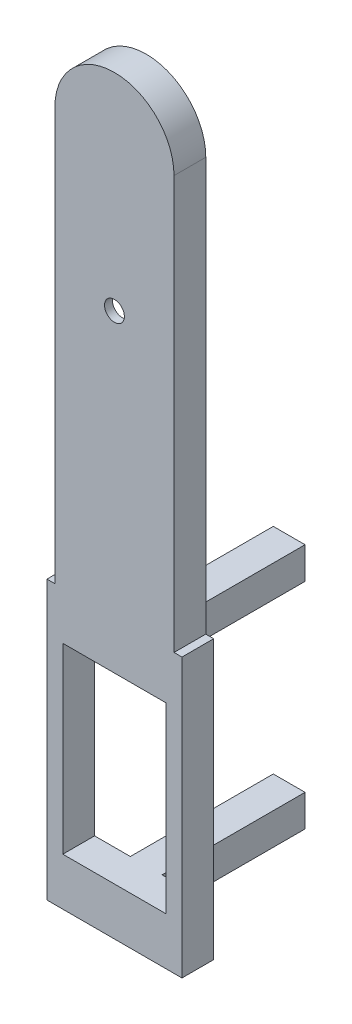
ISO-10303-21;
HEADER;
FILE_DESCRIPTION(('STEP AP214'),'2;1');
FILE_NAME('part.step','',(''),(''),'','','');
FILE_SCHEMA(('AUTOMOTIVE_DESIGN { 1 0 10303 214 1 1 1 1 }'));
ENDSEC;
DATA;
#1=APPLICATION_CONTEXT('core data for automotive mechanical design processes');
#2=APPLICATION_PROTOCOL_DEFINITION('international standard','automotive_design',2000,#1);
#3=PRODUCT_CONTEXT('',#1,'mechanical');
#4=PRODUCT('Part','Part','',(#3));
#5=PRODUCT_RELATED_PRODUCT_CATEGORY('part','',(#4));
#6=PRODUCT_DEFINITION_FORMATION('','',#4);
#7=PRODUCT_DEFINITION_CONTEXT('part definition',#1,'design');
#8=PRODUCT_DEFINITION('design','',#6,#7);
#9=PRODUCT_DEFINITION_SHAPE('','',#8);
#10=(LENGTH_UNIT() NAMED_UNIT(*) SI_UNIT(.MILLI.,.METRE.));
#11=(NAMED_UNIT(*) PLANE_ANGLE_UNIT() SI_UNIT($,.RADIAN.));
#12=(NAMED_UNIT(*) SI_UNIT($,.STERADIAN.) SOLID_ANGLE_UNIT());
#13=UNCERTAINTY_MEASURE_WITH_UNIT(LENGTH_MEASURE(1.E-05),#10,'distance_accuracy_value','');
#14=(GEOMETRIC_REPRESENTATION_CONTEXT(3) GLOBAL_UNCERTAINTY_ASSIGNED_CONTEXT((#13)) GLOBAL_UNIT_ASSIGNED_CONTEXT((#10,
#11,#12)) REPRESENTATION_CONTEXT('',''));
#15=CARTESIAN_POINT('',(0.,0.,0.));
#16=DIRECTION('',(0.,0.,1.));
#17=DIRECTION('',(1.,0.,0.));
#18=AXIS2_PLACEMENT_3D('',#15,#16,#17);
#19=CARTESIAN_POINT('',(0.,52.,4.));
#20=DIRECTION('',(0.,0.,1.));
#21=DIRECTION('',(1.,0.,0.));
#22=AXIS2_PLACEMENT_3D('',#19,#20,#21);
#23=PLANE('',#22);
#24=CARTESIAN_POINT('',(0.,33.5,4.));
#25=DIRECTION('',(0.,0.,1.));
#26=DIRECTION('',(1.,0.,0.));
#27=AXIS2_PLACEMENT_3D('',#24,#25,#26);
#28=CIRCLE('',#27,1.25);
#29=CARTESIAN_POINT('',(1.25,33.5,4.));
#30=VERTEX_POINT('',#29);
#31=EDGE_CURVE('E403',#30,#30,#28,.F.);
#32=ORIENTED_EDGE('',*,*,#31,.T.);
#33=EDGE_LOOP('',(#32));
#34=FACE_BOUND('',#33,.T.);
#35=DIRECTION('',(0.,-1.,0.));
#36=VECTOR('',#35,1.);
#37=CARTESIAN_POINT('',(-7.5,0.,4.));
#38=LINE('',#37,#36);
#39=CARTESIAN_POINT('',(-7.5,52.,4.));
#40=VERTEX_POINT('',#39);
#41=CARTESIAN_POINT('',(-7.5,0.,4.));
#42=VERTEX_POINT('',#41);
#43=EDGE_CURVE('E477',#40,#42,#38,.T.);
#44=ORIENTED_EDGE('',*,*,#43,.T.);
#45=DIRECTION('',(-1.,0.,0.));
#46=VECTOR('',#45,1.);
#47=CARTESIAN_POINT('',(8.50000000000001,0.,4.));
#48=LINE('',#47,#46);
#49=CARTESIAN_POINT('',(-8.49999999999999,0.,4.));
#50=VERTEX_POINT('',#49);
#51=EDGE_CURVE('E361',#42,#50,#48,.T.);
#52=ORIENTED_EDGE('',*,*,#51,.T.);
#53=DIRECTION('',(0.,-1.,0.));
#54=VECTOR('',#53,1.);
#55=CARTESIAN_POINT('',(-8.49999999999999,0.,4.));
#56=LINE('',#55,#54);
#57=CARTESIAN_POINT('',(-8.49999999999999,-35.,4.));
#58=VERTEX_POINT('',#57);
#59=EDGE_CURVE('E367',#50,#58,#56,.T.);
#60=ORIENTED_EDGE('',*,*,#59,.T.);
#61=DIRECTION('',(1.,0.,0.));
#62=VECTOR('',#61,1.);
#63=CARTESIAN_POINT('',(8.50000000000001,-35.,4.));
#64=LINE('',#63,#62);
#65=CARTESIAN_POINT('',(8.50000000000001,-35.,4.));
#66=VERTEX_POINT('',#65);
#67=EDGE_CURVE('E370',#58,#66,#64,.T.);
#68=ORIENTED_EDGE('',*,*,#67,.T.);
#69=DIRECTION('',(0.,1.,0.));
#70=VECTOR('',#69,1.);
#71=CARTESIAN_POINT('',(8.50000000000001,0.,4.));
#72=LINE('',#71,#70);
#73=CARTESIAN_POINT('',(8.50000000000001,0.,4.));
#74=VERTEX_POINT('',#73);
#75=EDGE_CURVE('E357',#66,#74,#72,.T.);
#76=ORIENTED_EDGE('',*,*,#75,.T.);
#77=CARTESIAN_POINT('',(7.5,0.,4.));
#78=VERTEX_POINT('',#77);
#79=EDGE_CURVE('E363',#74,#78,#48,.T.);
#80=ORIENTED_EDGE('',*,*,#79,.T.);
#81=DIRECTION('',(0.,1.,0.));
#82=VECTOR('',#81,1.);
#83=CARTESIAN_POINT('',(7.5,0.,4.));
#84=LINE('',#83,#82);
#85=CARTESIAN_POINT('',(7.5,52.,4.));
#86=VERTEX_POINT('',#85);
#87=EDGE_CURVE('E470',#78,#86,#84,.T.);
#88=ORIENTED_EDGE('',*,*,#87,.T.);
#89=CARTESIAN_POINT('',(0.,52.,4.));
#90=DIRECTION('',(0.,0.,1.));
#91=DIRECTION('',(1.,0.,0.));
#92=AXIS2_PLACEMENT_3D('',#89,#90,#91);
#93=CIRCLE('',#92,7.5);
#94=EDGE_CURVE('E473',#86,#40,#93,.T.);
#95=ORIENTED_EDGE('',*,*,#94,.T.);
#96=EDGE_LOOP('',(#44,#52,#60,#68,#76,#80,#88,#95));
#97=FACE_BOUND('',#96,.T.);
#98=DIRECTION('',(-1.,0.,0.));
#99=VECTOR('',#98,1.);
#100=CARTESIAN_POINT('',(0.,-29.,4.));
#101=LINE('',#100,#99);
#102=CARTESIAN_POINT('',(6.50000000000001,-29.,4.));
#103=VERTEX_POINT('',#102);
#104=CARTESIAN_POINT('',(-6.49999999999999,-29.,4.));
#105=VERTEX_POINT('',#104);
#106=EDGE_CURVE('E348',#103,#105,#101,.T.);
#107=ORIENTED_EDGE('',*,*,#106,.T.);
#108=DIRECTION('',(0.,1.,0.));
#109=VECTOR('',#108,1.);
#110=CARTESIAN_POINT('',(-6.5,52.,4.));
#111=LINE('',#110,#109);
#112=CARTESIAN_POINT('',(-6.49999999999999,-6.00000000000001,4.));
#113=VERTEX_POINT('',#112);
#114=EDGE_CURVE('E352',#105,#113,#111,.T.);
#115=ORIENTED_EDGE('',*,*,#114,.T.);
#116=DIRECTION('',(1.,0.,0.));
#117=VECTOR('',#116,1.);
#118=CARTESIAN_POINT('',(0.,-6.00000000000001,4.));
#119=LINE('',#118,#117);
#120=CARTESIAN_POINT('',(6.50000000000001,-6.00000000000001,4.));
#121=VERTEX_POINT('',#120);
#122=EDGE_CURVE('E340',#113,#121,#119,.T.);
#123=ORIENTED_EDGE('',*,*,#122,.T.);
#124=DIRECTION('',(0.,-1.,0.));
#125=VECTOR('',#124,1.);
#126=CARTESIAN_POINT('',(6.5,52.,4.));
#127=LINE('',#126,#125);
#128=EDGE_CURVE('E344',#121,#103,#127,.T.);
#129=ORIENTED_EDGE('',*,*,#128,.T.);
#130=EDGE_LOOP('',(#107,#115,#123,#129));
#131=FACE_BOUND('',#130,.T.);
#132=ADVANCED_FACE('F39',(#34,#97,#131),#23,.T.);
#133=CARTESIAN_POINT('',(0.,52.,0.));
#134=DIRECTION('',(0.,0.,1.));
#135=DIRECTION('',(1.,0.,0.));
#136=AXIS2_PLACEMENT_3D('',#133,#134,#135);
#137=PLANE('',#136);
#138=DIRECTION('',(0.,1.,0.));
#139=VECTOR('',#138,1.);
#140=CARTESIAN_POINT('',(7.5,0.,0.));
#141=LINE('',#140,#139);
#142=CARTESIAN_POINT('',(7.5,0.,0.));
#143=VERTEX_POINT('',#142);
#144=CARTESIAN_POINT('',(7.5,52.,0.));
#145=VERTEX_POINT('',#144);
#146=EDGE_CURVE('E469',#143,#145,#141,.T.);
#147=ORIENTED_EDGE('',*,*,#146,.F.);
#148=DIRECTION('',(-1.,0.,0.));
#149=VECTOR('',#148,1.);
#150=CARTESIAN_POINT('',(8.50000000000001,0.,0.));
#151=LINE('',#150,#149);
#152=CARTESIAN_POINT('',(8.50000000000001,0.,0.));
#153=VERTEX_POINT('',#152);
#154=EDGE_CURVE('E378',#153,#143,#151,.T.);
#155=ORIENTED_EDGE('',*,*,#154,.F.);
#156=DIRECTION('',(0.,1.,0.));
#157=VECTOR('',#156,1.);
#158=CARTESIAN_POINT('',(8.50000000000001,0.,0.));
#159=LINE('',#158,#157);
#160=CARTESIAN_POINT('',(8.50000000000001,-35.,0.));
#161=VERTEX_POINT('',#160);
#162=EDGE_CURVE('E356',#161,#153,#159,.T.);
#163=ORIENTED_EDGE('',*,*,#162,.F.);
#164=DIRECTION('',(1.,0.,0.));
#165=VECTOR('',#164,1.);
#166=CARTESIAN_POINT('',(8.50000000000001,-35.,0.));
#167=LINE('',#166,#165);
#168=CARTESIAN_POINT('',(-8.49999999999999,-35.,0.));
#169=VERTEX_POINT('',#168);
#170=EDGE_CURVE('E362',#169,#161,#167,.T.);
#171=ORIENTED_EDGE('',*,*,#170,.F.);
#172=DIRECTION('',(0.,-1.,0.));
#173=VECTOR('',#172,1.);
#174=CARTESIAN_POINT('',(-8.49999999999999,0.,0.));
#175=LINE('',#174,#173);
#176=CARTESIAN_POINT('',(-8.49999999999999,0.,0.));
#177=VERTEX_POINT('',#176);
#178=EDGE_CURVE('E382',#177,#169,#175,.T.);
#179=ORIENTED_EDGE('',*,*,#178,.F.);
#180=CARTESIAN_POINT('',(-7.5,0.,0.));
#181=VERTEX_POINT('',#180);
#182=EDGE_CURVE('E377',#181,#177,#151,.T.);
#183=ORIENTED_EDGE('',*,*,#182,.F.);
#184=DIRECTION('',(0.,-1.,0.));
#185=VECTOR('',#184,1.);
#186=CARTESIAN_POINT('',(-7.5,0.,0.));
#187=LINE('',#186,#185);
#188=CARTESIAN_POINT('',(-7.5,52.,0.));
#189=VERTEX_POINT('',#188);
#190=EDGE_CURVE('E474',#189,#181,#187,.T.);
#191=ORIENTED_EDGE('',*,*,#190,.F.);
#192=CARTESIAN_POINT('',(0.,52.,0.));
#193=DIRECTION('',(0.,0.,1.));
#194=DIRECTION('',(1.,0.,0.));
#195=AXIS2_PLACEMENT_3D('',#192,#193,#194);
#196=CIRCLE('',#195,7.5);
#197=EDGE_CURVE('E483',#145,#189,#196,.T.);
#198=ORIENTED_EDGE('',*,*,#197,.F.);
#199=EDGE_LOOP('',(#147,#155,#163,#171,#179,#183,#191,#198));
#200=FACE_BOUND('',#199,.T.);
#201=DIRECTION('',(-0.161684528353419,0.986842496699008,0.));
#202=VECTOR('',#201,1.);
#203=CARTESIAN_POINT('',(10.214455548325,1.67353902293652,0.));
#204=LINE('',#203,#202);
#205=CARTESIAN_POINT('',(5.,33.5,0.));
#206=VERTEX_POINT('',#205);
#207=CARTESIAN_POINT('',(2.5,48.7587651204003,0.));
#208=VERTEX_POINT('',#207);
#209=EDGE_CURVE('E413',#206,#208,#204,.T.);
#210=ORIENTED_EDGE('',*,*,#209,.T.);
#211=CARTESIAN_POINT('',(0.,48.7587651204003,0.));
#212=DIRECTION('',(0.,0.,1.));
#213=DIRECTION('',(1.,0.,0.));
#214=AXIS2_PLACEMENT_3D('',#211,#212,#213);
#215=CIRCLE('',#214,2.5);
#216=CARTESIAN_POINT('',(-2.5,48.7587651204003,0.));
#217=VERTEX_POINT('',#216);
#218=EDGE_CURVE('E407',#217,#208,#215,.F.);
#219=ORIENTED_EDGE('',*,*,#218,.F.);
#220=DIRECTION('',(-0.161684528353419,-0.986842496699008,0.));
#221=VECTOR('',#220,1.);
#222=CARTESIAN_POINT('',(-10.214455548325,1.67353902293652,0.));
#223=LINE('',#222,#221);
#224=CARTESIAN_POINT('',(-5.,33.5,0.));
#225=VERTEX_POINT('',#224);
#226=EDGE_CURVE('E432',#217,#225,#223,.T.);
#227=ORIENTED_EDGE('',*,*,#226,.T.);
#228=DIRECTION('',(0.161684528353559,-0.986842496698985,0.));
#229=VECTOR('',#228,1.);
#230=CARTESIAN_POINT('',(0.475874415418367,0.0779673865584585,0.));
#231=LINE('',#230,#229);
#232=CARTESIAN_POINT('',(-2.49999999999778,18.2412348795997,0.));
#233=VERTEX_POINT('',#232);
#234=EDGE_CURVE('E436',#225,#233,#231,.T.);
#235=ORIENTED_EDGE('',*,*,#234,.T.);
#236=CARTESIAN_POINT('',(0.,18.2412348795997,0.));
#237=DIRECTION('',(0.,0.,1.));
#238=DIRECTION('',(1.,0.,0.));
#239=AXIS2_PLACEMENT_3D('',#236,#237,#238);
#240=CIRCLE('',#239,2.49999999999778);
#241=CARTESIAN_POINT('',(2.46793907135045,17.8421399784913,0.));
#242=VERTEX_POINT('',#241);
#243=EDGE_CURVE('E440',#233,#242,#240,.T.);
#244=ORIENTED_EDGE('',*,*,#243,.T.);
#245=DIRECTION('',(-0.159637960443526,-0.987175628541057,0.));
#246=VECTOR('',#245,1.);
#247=CARTESIAN_POINT('',(-0.40670997405781,0.0657698071888002,0.));
#248=LINE('',#247,#246);
#249=EDGE_CURVE('E444',#206,#242,#248,.T.);
#250=ORIENTED_EDGE('',*,*,#249,.F.);
#251=EDGE_LOOP('',(#210,#219,#227,#235,#244,#250));
#252=FACE_BOUND('',#251,.T.);
#253=DIRECTION('',(1.,0.,0.));
#254=VECTOR('',#253,1.);
#255=CARTESIAN_POINT('',(2.00000000000001,-33.,0.));
#256=LINE('',#255,#254);
#257=CARTESIAN_POINT('',(-1.99999999999999,-33.,0.));
#258=VERTEX_POINT('',#257);
#259=CARTESIAN_POINT('',(2.00000000000001,-33.,0.));
#260=VERTEX_POINT('',#259);
#261=EDGE_CURVE('E55',#258,#260,#256,.T.);
#262=ORIENTED_EDGE('',*,*,#261,.T.);
#263=DIRECTION('',(0.,1.,0.));
#264=VECTOR('',#263,1.);
#265=CARTESIAN_POINT('',(2.00000000000001,-33.,0.));
#266=LINE('',#265,#264);
#267=CARTESIAN_POINT('',(2.00000000000001,-29.,0.));
#268=VERTEX_POINT('',#267);
#269=EDGE_CURVE('E251',#260,#268,#266,.T.);
#270=ORIENTED_EDGE('',*,*,#269,.T.);
#271=DIRECTION('',(1.,0.,0.));
#272=VECTOR('',#271,1.);
#273=CARTESIAN_POINT('',(-6.49999999999999,-29.,0.));
#274=LINE('',#273,#272);
#275=CARTESIAN_POINT('',(6.50000000000001,-29.,0.));
#276=VERTEX_POINT('',#275);
#277=EDGE_CURVE('E219',#268,#276,#274,.T.);
#278=ORIENTED_EDGE('',*,*,#277,.T.);
#279=DIRECTION('',(0.,1.,0.));
#280=VECTOR('',#279,1.);
#281=CARTESIAN_POINT('',(6.50000000000001,-6.00000000000001,0.));
#282=LINE('',#281,#280);
#283=CARTESIAN_POINT('',(6.50000000000001,-6.00000000000001,0.));
#284=VERTEX_POINT('',#283);
#285=EDGE_CURVE('E318',#276,#284,#282,.T.);
#286=ORIENTED_EDGE('',*,*,#285,.T.);
#287=DIRECTION('',(-1.,0.,0.));
#288=VECTOR('',#287,1.);
#289=CARTESIAN_POINT('',(-6.49999999999999,-6.00000000000001,0.));
#290=LINE('',#289,#288);
#291=CARTESIAN_POINT('',(2.00000000000001,-6.00000000000001,0.));
#292=VERTEX_POINT('',#291);
#293=EDGE_CURVE('E323',#284,#292,#290,.T.);
#294=ORIENTED_EDGE('',*,*,#293,.T.);
#295=DIRECTION('',(0.,1.,0.));
#296=VECTOR('',#295,1.);
#297=CARTESIAN_POINT('',(2.00000000000001,-2.00000000000001,0.));
#298=LINE('',#297,#296);
#299=CARTESIAN_POINT('',(2.00000000000001,-2.00000000000001,0.));
#300=VERTEX_POINT('',#299);
#301=EDGE_CURVE('E267',#292,#300,#298,.T.);
#302=ORIENTED_EDGE('',*,*,#301,.T.);
#303=DIRECTION('',(-1.,0.,0.));
#304=VECTOR('',#303,1.);
#305=CARTESIAN_POINT('',(2.00000000000001,-2.00000000000001,0.));
#306=LINE('',#305,#304);
#307=CARTESIAN_POINT('',(-1.99999999999999,-2.00000000000001,0.));
#308=VERTEX_POINT('',#307);
#309=EDGE_CURVE('E293',#300,#308,#306,.T.);
#310=ORIENTED_EDGE('',*,*,#309,.T.);
#311=DIRECTION('',(0.,-1.,0.));
#312=VECTOR('',#311,1.);
#313=CARTESIAN_POINT('',(-1.99999999999999,-2.00000000000001,0.));
#314=LINE('',#313,#312);
#315=CARTESIAN_POINT('',(-1.99999999999999,-6.00000000000001,0.));
#316=VERTEX_POINT('',#315);
#317=EDGE_CURVE('E277',#308,#316,#314,.T.);
#318=ORIENTED_EDGE('',*,*,#317,.T.);
#319=CARTESIAN_POINT('',(-6.49999999999999,-6.00000000000001,0.));
#320=VERTEX_POINT('',#319);
#321=EDGE_CURVE('E322',#316,#320,#290,.T.);
#322=ORIENTED_EDGE('',*,*,#321,.T.);
#323=DIRECTION('',(0.,-1.,0.));
#324=VECTOR('',#323,1.);
#325=CARTESIAN_POINT('',(-6.49999999999999,-6.00000000000001,0.));
#326=LINE('',#325,#324);
#327=CARTESIAN_POINT('',(-6.49999999999999,-29.,0.));
#328=VERTEX_POINT('',#327);
#329=EDGE_CURVE('E303',#320,#328,#326,.T.);
#330=ORIENTED_EDGE('',*,*,#329,.T.);
#331=CARTESIAN_POINT('',(-1.99999999999999,-29.,0.));
#332=VERTEX_POINT('',#331);
#333=EDGE_CURVE('E315',#328,#332,#274,.T.);
#334=ORIENTED_EDGE('',*,*,#333,.T.);
#335=DIRECTION('',(0.,-1.,0.));
#336=VECTOR('',#335,1.);
#337=CARTESIAN_POINT('',(-1.99999999999999,-33.,0.));
#338=LINE('',#337,#336);
#339=EDGE_CURVE('E60',#332,#258,#338,.T.);
#340=ORIENTED_EDGE('',*,*,#339,.T.);
#341=EDGE_LOOP('',(#262,#270,#278,#286,#294,#302,#310,#318,#322,#330,#334,#340));
#342=FACE_BOUND('',#341,.T.);
#343=ADVANCED_FACE('F526',(#200,#252,#342),#137,.F.);
#344=CARTESIAN_POINT('',(7.5,0.,4.));
#345=DIRECTION('',(-1.,0.,0.));
#346=DIRECTION('',(0.,0.,1.));
#347=AXIS2_PLACEMENT_3D('',#344,#345,#346);
#348=PLANE('',#347);
#349=ORIENTED_EDGE('',*,*,#146,.T.);
#350=DIRECTION('',(0.,0.,-1.));
#351=VECTOR('',#350,1.);
#352=CARTESIAN_POINT('',(7.5,52.,4.));
#353=LINE('',#352,#351);
#354=EDGE_CURVE('E495',#86,#145,#353,.T.);
#355=ORIENTED_EDGE('',*,*,#354,.F.);
#356=ORIENTED_EDGE('',*,*,#87,.F.);
#357=DIRECTION('',(0.,0.,-1.));
#358=VECTOR('',#357,1.);
#359=CARTESIAN_POINT('',(7.5,0.,4.));
#360=LINE('',#359,#358);
#361=EDGE_CURVE('E271',#78,#143,#360,.T.);
#362=ORIENTED_EDGE('',*,*,#361,.T.);
#363=EDGE_LOOP('',(#349,#355,#356,#362));
#364=FACE_BOUND('',#363,.T.);
#365=ADVANCED_FACE('F41',(#364),#348,.F.);
#366=CARTESIAN_POINT('',(0.,52.,4.));
#367=DIRECTION('',(0.,0.,-1.));
#368=DIRECTION('',(-1.,0.,0.));
#369=AXIS2_PLACEMENT_3D('',#366,#367,#368);
#370=CYLINDRICAL_SURFACE('',#369,7.5);
#371=ORIENTED_EDGE('',*,*,#197,.T.);
#372=DIRECTION('',(0.,0.,-1.));
#373=VECTOR('',#372,1.);
#374=CARTESIAN_POINT('',(-7.5,52.,4.));
#375=LINE('',#374,#373);
#376=EDGE_CURVE('E491',#40,#189,#375,.T.);
#377=ORIENTED_EDGE('',*,*,#376,.F.);
#378=ORIENTED_EDGE('',*,*,#94,.F.);
#379=ORIENTED_EDGE('',*,*,#354,.T.);
#380=EDGE_LOOP('',(#371,#377,#378,#379));
#381=FACE_BOUND('',#380,.T.);
#382=ADVANCED_FACE('F563',(#381),#370,.T.);
#383=CARTESIAN_POINT('',(-7.5,0.,4.));
#384=DIRECTION('',(1.,0.,0.));
#385=DIRECTION('',(0.,0.,-1.));
#386=AXIS2_PLACEMENT_3D('',#383,#384,#385);
#387=PLANE('',#386);
#388=ORIENTED_EDGE('',*,*,#190,.T.);
#389=DIRECTION('',(0.,0.,-1.));
#390=VECTOR('',#389,1.);
#391=CARTESIAN_POINT('',(-7.5,0.,4.));
#392=LINE('',#391,#390);
#393=EDGE_CURVE('E480',#42,#181,#392,.T.);
#394=ORIENTED_EDGE('',*,*,#393,.F.);
#395=ORIENTED_EDGE('',*,*,#43,.F.);
#396=ORIENTED_EDGE('',*,*,#376,.T.);
#397=EDGE_LOOP('',(#388,#394,#395,#396));
#398=FACE_BOUND('',#397,.T.);
#399=ADVANCED_FACE('F548',(#398),#387,.F.);
#400=CARTESIAN_POINT('',(0.,48.7587651204003,3.));
#401=DIRECTION('',(0.,0.,-1.));
#402=DIRECTION('',(-1.,0.,0.));
#403=AXIS2_PLACEMENT_3D('',#400,#401,#402);
#404=CYLINDRICAL_SURFACE('',#403,2.5);
#405=ORIENTED_EDGE('',*,*,#218,.T.);
#406=DIRECTION('',(0.,0.,-1.));
#407=VECTOR('',#406,1.);
#408=CARTESIAN_POINT('',(2.5,48.7587651204003,3.));
#409=LINE('',#408,#407);
#410=CARTESIAN_POINT('',(2.5,48.7587651204003,3.));
#411=VERTEX_POINT('',#410);
#412=EDGE_CURVE('E429',#411,#208,#409,.T.);
#413=ORIENTED_EDGE('',*,*,#412,.F.);
#414=CARTESIAN_POINT('',(0.,48.7587651204003,3.));
#415=DIRECTION('',(0.,0.,1.));
#416=DIRECTION('',(1.,0.,0.));
#417=AXIS2_PLACEMENT_3D('',#414,#415,#416);
#418=CIRCLE('',#417,2.5);
#419=CARTESIAN_POINT('',(-2.5,48.7587651204003,3.));
#420=VERTEX_POINT('',#419);
#421=EDGE_CURVE('E408',#420,#411,#418,.F.);
#422=ORIENTED_EDGE('',*,*,#421,.F.);
#423=DIRECTION('',(0.,0.,-1.));
#424=VECTOR('',#423,1.);
#425=CARTESIAN_POINT('',(-2.5,48.7587651204003,3.));
#426=LINE('',#425,#424);
#427=EDGE_CURVE('E466',#420,#217,#426,.T.);
#428=ORIENTED_EDGE('',*,*,#427,.T.);
#429=EDGE_LOOP('',(#405,#413,#422,#428));
#430=FACE_BOUND('',#429,.T.);
#431=ADVANCED_FACE('F519',(#430),#404,.F.);
#432=CARTESIAN_POINT('',(-10.214455548325,1.67353902293652,3.));
#433=DIRECTION('',(0.986842496699008,-0.161684528353419,0.));
#434=DIRECTION('',(0.161684528353419,0.986842496699008,0.));
#435=AXIS2_PLACEMENT_3D('',#432,#433,#434);
#436=PLANE('',#435);
#437=ORIENTED_EDGE('',*,*,#226,.F.);
#438=ORIENTED_EDGE('',*,*,#427,.F.);
#439=DIRECTION('',(-0.161684528353419,-0.986842496699008,0.));
#440=VECTOR('',#439,1.);
#441=CARTESIAN_POINT('',(-10.214455548325,1.67353902293652,3.));
#442=LINE('',#441,#440);
#443=CARTESIAN_POINT('',(-5.,33.5,3.));
#444=VERTEX_POINT('',#443);
#445=EDGE_CURVE('E412',#420,#444,#442,.T.);
#446=ORIENTED_EDGE('',*,*,#445,.T.);
#447=DIRECTION('',(0.,0.,-1.));
#448=VECTOR('',#447,1.);
#449=CARTESIAN_POINT('',(-5.,33.5,3.));
#450=LINE('',#449,#448);
#451=EDGE_CURVE('E463',#444,#225,#450,.T.);
#452=ORIENTED_EDGE('',*,*,#451,.T.);
#453=EDGE_LOOP('',(#437,#438,#446,#452));
#454=FACE_BOUND('',#453,.T.);
#455=ADVANCED_FACE('F540',(#454),#436,.T.);
#456=CARTESIAN_POINT('',(0.475874415418367,0.0779673865584585,3.));
#457=DIRECTION('',(0.986842496698985,0.161684528353559,0.));
#458=DIRECTION('',(-0.161684528353559,0.986842496698985,0.));
#459=AXIS2_PLACEMENT_3D('',#456,#457,#458);
#460=PLANE('',#459);
#461=ORIENTED_EDGE('',*,*,#234,.F.);
#462=ORIENTED_EDGE('',*,*,#451,.F.);
#463=DIRECTION('',(0.161684528353559,-0.986842496698985,0.));
#464=VECTOR('',#463,1.);
#465=CARTESIAN_POINT('',(0.475874415418367,0.0779673865584585,3.));
#466=LINE('',#465,#464);
#467=CARTESIAN_POINT('',(-2.49999999999778,18.2412348795997,3.));
#468=VERTEX_POINT('',#467);
#469=EDGE_CURVE('E416',#444,#468,#466,.T.);
#470=ORIENTED_EDGE('',*,*,#469,.T.);
#471=DIRECTION('',(0.,0.,-1.));
#472=VECTOR('',#471,1.);
#473=CARTESIAN_POINT('',(-2.49999999999778,18.2412348795997,3.));
#474=LINE('',#473,#472);
#475=EDGE_CURVE('E460',#468,#233,#474,.T.);
#476=ORIENTED_EDGE('',*,*,#475,.T.);
#477=EDGE_LOOP('',(#461,#462,#470,#476));
#478=FACE_BOUND('',#477,.T.);
#479=ADVANCED_FACE('F537',(#478),#460,.T.);
#480=CARTESIAN_POINT('',(0.,18.2412348795997,3.));
#481=DIRECTION('',(0.,0.,-1.));
#482=DIRECTION('',(-1.,0.,0.));
#483=AXIS2_PLACEMENT_3D('',#480,#481,#482);
#484=CYLINDRICAL_SURFACE('',#483,2.49999999999778);
#485=ORIENTED_EDGE('',*,*,#243,.F.);
#486=ORIENTED_EDGE('',*,*,#475,.F.);
#487=CARTESIAN_POINT('',(0.,18.2412348795997,3.));
#488=DIRECTION('',(0.,0.,1.));
#489=DIRECTION('',(1.,0.,0.));
#490=AXIS2_PLACEMENT_3D('',#487,#488,#489);
#491=CIRCLE('',#490,2.49999999999778);
#492=CARTESIAN_POINT('',(2.46793907135045,17.8421399784913,3.));
#493=VERTEX_POINT('',#492);
#494=EDGE_CURVE('E419',#468,#493,#491,.T.);
#495=ORIENTED_EDGE('',*,*,#494,.T.);
#496=DIRECTION('',(0.,0.,-1.));
#497=VECTOR('',#496,1.);
#498=CARTESIAN_POINT('',(2.46793907135045,17.8421399784913,3.));
#499=LINE('',#498,#497);
#500=EDGE_CURVE('E457',#493,#242,#499,.T.);
#501=ORIENTED_EDGE('',*,*,#500,.T.);
#502=EDGE_LOOP('',(#485,#486,#495,#501));
#503=FACE_BOUND('',#502,.T.);
#504=ADVANCED_FACE('F534',(#503),#484,.F.);
#505=CARTESIAN_POINT('',(-0.40670997405781,0.0657698071888002,3.));
#506=DIRECTION('',(0.987175628541057,-0.159637960443526,0.));
#507=DIRECTION('',(0.159637960443526,0.987175628541057,0.));
#508=AXIS2_PLACEMENT_3D('',#505,#506,#507);
#509=PLANE('',#508);
#510=ORIENTED_EDGE('',*,*,#249,.T.);
#511=ORIENTED_EDGE('',*,*,#500,.F.);
#512=DIRECTION('',(-0.159637960443526,-0.987175628541057,0.));
#513=VECTOR('',#512,1.);
#514=CARTESIAN_POINT('',(-0.40670997405781,0.0657698071888002,3.));
#515=LINE('',#514,#513);
#516=CARTESIAN_POINT('',(5.,33.5,3.));
#517=VERTEX_POINT('',#516);
#518=EDGE_CURVE('E422',#517,#493,#515,.T.);
#519=ORIENTED_EDGE('',*,*,#518,.F.);
#520=DIRECTION('',(0.,0.,-1.));
#521=VECTOR('',#520,1.);
#522=CARTESIAN_POINT('',(5.,33.5,3.));
#523=LINE('',#522,#521);
#524=EDGE_CURVE('E454',#517,#206,#523,.T.);
#525=ORIENTED_EDGE('',*,*,#524,.T.);
#526=EDGE_LOOP('',(#510,#511,#519,#525));
#527=FACE_BOUND('',#526,.T.);
#528=ADVANCED_FACE('F530',(#527),#509,.F.);
#529=CARTESIAN_POINT('',(10.214455548325,1.67353902293652,3.));
#530=DIRECTION('',(-0.986842496699008,-0.161684528353419,0.));
#531=DIRECTION('',(0.161684528353419,-0.986842496699008,0.));
#532=AXIS2_PLACEMENT_3D('',#529,#530,#531);
#533=PLANE('',#532);
#534=ORIENTED_EDGE('',*,*,#209,.F.);
#535=ORIENTED_EDGE('',*,*,#524,.F.);
#536=DIRECTION('',(-0.161684528353419,0.986842496699008,0.));
#537=VECTOR('',#536,1.);
#538=CARTESIAN_POINT('',(10.214455548325,1.67353902293652,3.));
#539=LINE('',#538,#537);
#540=EDGE_CURVE('E426',#517,#411,#539,.T.);
#541=ORIENTED_EDGE('',*,*,#540,.T.);
#542=ORIENTED_EDGE('',*,*,#412,.T.);
#543=EDGE_LOOP('',(#534,#535,#541,#542));
#544=FACE_BOUND('',#543,.T.);
#545=ADVANCED_FACE('F510',(#544),#533,.T.);
#546=CARTESIAN_POINT('',(0.,0.,3.));
#547=DIRECTION('',(0.,0.,1.));
#548=DIRECTION('',(1.,0.,0.));
#549=AXIS2_PLACEMENT_3D('',#546,#547,#548);
#550=PLANE('',#549);
#551=CARTESIAN_POINT('',(0.,33.5,3.));
#552=DIRECTION('',(0.,0.,1.));
#553=DIRECTION('',(1.,0.,0.));
#554=AXIS2_PLACEMENT_3D('',#551,#552,#553);
#555=CIRCLE('',#554,1.25);
#556=CARTESIAN_POINT('',(1.25,33.5,3.));
#557=VERTEX_POINT('',#556);
#558=EDGE_CURVE('E402',#557,#557,#555,.F.);
#559=ORIENTED_EDGE('',*,*,#558,.F.);
#560=EDGE_LOOP('',(#559));
#561=FACE_BOUND('',#560,.T.);
#562=ORIENTED_EDGE('',*,*,#421,.T.);
#563=ORIENTED_EDGE('',*,*,#540,.F.);
#564=ORIENTED_EDGE('',*,*,#518,.T.);
#565=ORIENTED_EDGE('',*,*,#494,.F.);
#566=ORIENTED_EDGE('',*,*,#469,.F.);
#567=ORIENTED_EDGE('',*,*,#445,.F.);
#568=EDGE_LOOP('',(#562,#563,#564,#565,#566,#567));
#569=FACE_BOUND('',#568,.T.);
#570=ADVANCED_FACE('F507',(#561,#569),#550,.F.);
#571=CARTESIAN_POINT('',(0.,33.5,12.4));
#572=DIRECTION('',(0.,0.,-1.));
#573=DIRECTION('',(-1.,0.,0.));
#574=AXIS2_PLACEMENT_3D('',#571,#572,#573);
#575=CYLINDRICAL_SURFACE('',#574,1.25);
#576=ORIENTED_EDGE('',*,*,#31,.F.);
#577=EDGE_LOOP('',(#576));
#578=FACE_BOUND('',#577,.T.);
#579=ORIENTED_EDGE('',*,*,#558,.T.);
#580=EDGE_LOOP('',(#579));
#581=FACE_BOUND('',#580,.T.);
#582=ADVANCED_FACE('F505',(#578,#581),#575,.F.);
#583=CARTESIAN_POINT('',(8.50000000000001,0.,4.));
#584=DIRECTION('',(0.,-1.,0.));
#585=DIRECTION('',(1.,0.,0.));
#586=AXIS2_PLACEMENT_3D('',#583,#584,#585);
#587=PLANE('',#586);
#588=ORIENTED_EDGE('',*,*,#51,.F.);
#589=ORIENTED_EDGE('',*,*,#393,.T.);
#590=ORIENTED_EDGE('',*,*,#182,.T.);
#591=DIRECTION('',(0.,0.,-1.));
#592=VECTOR('',#591,1.);
#593=CARTESIAN_POINT('',(-8.49999999999999,0.,4.));
#594=LINE('',#593,#592);
#595=EDGE_CURVE('E394',#50,#177,#594,.T.);
#596=ORIENTED_EDGE('',*,*,#595,.F.);
#597=EDGE_LOOP('',(#588,#589,#590,#596));
#598=FACE_BOUND('',#597,.T.);
#599=ADVANCED_FACE('F664',(#598),#587,.F.);
#600=CARTESIAN_POINT('',(8.50000000000001,0.,4.));
#601=DIRECTION('',(-1.,0.,0.));
#602=DIRECTION('',(0.,-1.,0.));
#603=AXIS2_PLACEMENT_3D('',#600,#601,#602);
#604=PLANE('',#603);
#605=ORIENTED_EDGE('',*,*,#162,.T.);
#606=DIRECTION('',(0.,0.,-1.));
#607=VECTOR('',#606,1.);
#608=CARTESIAN_POINT('',(8.50000000000001,0.,4.));
#609=LINE('',#608,#607);
#610=EDGE_CURVE('E398',#74,#153,#609,.T.);
#611=ORIENTED_EDGE('',*,*,#610,.F.);
#612=ORIENTED_EDGE('',*,*,#75,.F.);
#613=DIRECTION('',(0.,0.,-1.));
#614=VECTOR('',#613,1.);
#615=CARTESIAN_POINT('',(8.50000000000001,-35.,4.));
#616=LINE('',#615,#614);
#617=EDGE_CURVE('E373',#66,#161,#616,.T.);
#618=ORIENTED_EDGE('',*,*,#617,.T.);
#619=EDGE_LOOP('',(#605,#611,#612,#618));
#620=FACE_BOUND('',#619,.T.);
#621=ADVANCED_FACE('F662',(#620),#604,.F.);
#622=ORIENTED_EDGE('',*,*,#361,.F.);
#623=ORIENTED_EDGE('',*,*,#79,.F.);
#624=ORIENTED_EDGE('',*,*,#610,.T.);
#625=ORIENTED_EDGE('',*,*,#154,.T.);
#626=EDGE_LOOP('',(#622,#623,#624,#625));
#627=FACE_BOUND('',#626,.T.);
#628=ADVANCED_FACE('F658',(#627),#587,.F.);
#629=CARTESIAN_POINT('',(-8.49999999999999,0.,4.));
#630=DIRECTION('',(1.,0.,0.));
#631=DIRECTION('',(0.,1.,0.));
#632=AXIS2_PLACEMENT_3D('',#629,#630,#631);
#633=PLANE('',#632);
#634=ORIENTED_EDGE('',*,*,#178,.T.);
#635=DIRECTION('',(0.,0.,-1.));
#636=VECTOR('',#635,1.);
#637=CARTESIAN_POINT('',(-8.49999999999999,-35.,4.));
#638=LINE('',#637,#636);
#639=EDGE_CURVE('E390',#58,#169,#638,.T.);
#640=ORIENTED_EDGE('',*,*,#639,.F.);
#641=ORIENTED_EDGE('',*,*,#59,.F.);
#642=ORIENTED_EDGE('',*,*,#595,.T.);
#643=EDGE_LOOP('',(#634,#640,#641,#642));
#644=FACE_BOUND('',#643,.T.);
#645=ADVANCED_FACE('F654',(#644),#633,.F.);
#646=CARTESIAN_POINT('',(8.50000000000001,-35.,4.));
#647=DIRECTION('',(0.,1.,0.));
#648=DIRECTION('',(0.,0.,1.));
#649=AXIS2_PLACEMENT_3D('',#646,#647,#648);
#650=PLANE('',#649);
#651=ORIENTED_EDGE('',*,*,#170,.T.);
#652=ORIENTED_EDGE('',*,*,#617,.F.);
#653=ORIENTED_EDGE('',*,*,#67,.F.);
#654=ORIENTED_EDGE('',*,*,#639,.T.);
#655=EDGE_LOOP('',(#651,#652,#653,#654));
#656=FACE_BOUND('',#655,.T.);
#657=ADVANCED_FACE('F651',(#656),#650,.F.);
#658=CARTESIAN_POINT('',(-6.49999999999999,-6.00000000000001,12.1));
#659=DIRECTION('',(1.,0.,0.));
#660=DIRECTION('',(0.,1.,0.));
#661=AXIS2_PLACEMENT_3D('',#658,#659,#660);
#662=PLANE('',#661);
#663=DIRECTION('',(0.,0.,-1.));
#664=VECTOR('',#663,1.);
#665=CARTESIAN_POINT('',(-6.49999999999999,-29.,12.1));
#666=LINE('',#665,#664);
#667=EDGE_CURVE('E337',#105,#328,#666,.T.);
#668=ORIENTED_EDGE('',*,*,#667,.T.);
#669=ORIENTED_EDGE('',*,*,#329,.F.);
#670=DIRECTION('',(0.,0.,-1.));
#671=VECTOR('',#670,1.);
#672=CARTESIAN_POINT('',(-6.49999999999999,-6.00000000000001,12.1));
#673=LINE('',#672,#671);
#674=EDGE_CURVE('E327',#113,#320,#673,.T.);
#675=ORIENTED_EDGE('',*,*,#674,.F.);
#676=ORIENTED_EDGE('',*,*,#114,.F.);
#677=EDGE_LOOP('',(#668,#669,#675,#676));
#678=FACE_BOUND('',#677,.T.);
#679=ADVANCED_FACE('F611',(#678),#662,.T.);
#680=CARTESIAN_POINT('',(-6.49999999999999,-29.,12.1));
#681=DIRECTION('',(0.,1.,0.));
#682=DIRECTION('',(0.,0.,1.));
#683=AXIS2_PLACEMENT_3D('',#680,#681,#682);
#684=PLANE('',#683);
#685=DIRECTION('',(0.,0.,-1.));
#686=VECTOR('',#685,1.);
#687=CARTESIAN_POINT('',(6.50000000000001,-29.,12.1));
#688=LINE('',#687,#686);
#689=EDGE_CURVE('E334',#103,#276,#688,.T.);
#690=ORIENTED_EDGE('',*,*,#689,.T.);
#691=ORIENTED_EDGE('',*,*,#277,.F.);
#692=DIRECTION('',(0.,0.,1.));
#693=VECTOR('',#692,1.);
#694=CARTESIAN_POINT('',(2.00000000000001,-29.,-18.));
#695=LINE('',#694,#693);
#696=CARTESIAN_POINT('',(2.00000000000001,-29.,-18.));
#697=VERTEX_POINT('',#696);
#698=EDGE_CURVE('E213',#697,#268,#695,.T.);
#699=ORIENTED_EDGE('',*,*,#698,.F.);
#700=DIRECTION('',(-1.,0.,0.));
#701=VECTOR('',#700,1.);
#702=CARTESIAN_POINT('',(2.00000000000001,-29.,-18.));
#703=LINE('',#702,#701);
#704=CARTESIAN_POINT('',(-1.99999999999999,-29.,-18.));
#705=VERTEX_POINT('',#704);
#706=EDGE_CURVE('E218',#697,#705,#703,.T.);
#707=ORIENTED_EDGE('',*,*,#706,.T.);
#708=DIRECTION('',(0.,0.,1.));
#709=VECTOR('',#708,1.);
#710=CARTESIAN_POINT('',(-1.99999999999999,-29.,-18.));
#711=LINE('',#710,#709);
#712=EDGE_CURVE('E224',#705,#332,#711,.T.);
#713=ORIENTED_EDGE('',*,*,#712,.T.);
#714=ORIENTED_EDGE('',*,*,#333,.F.);
#715=ORIENTED_EDGE('',*,*,#667,.F.);
#716=ORIENTED_EDGE('',*,*,#106,.F.);
#717=EDGE_LOOP('',(#690,#691,#699,#707,#713,#714,#715,#716));
#718=FACE_BOUND('',#717,.T.);
#719=ADVANCED_FACE('F216',(#718),#684,.T.);
#720=CARTESIAN_POINT('',(6.50000000000001,-6.00000000000001,12.1));
#721=DIRECTION('',(-1.,0.,0.));
#722=DIRECTION('',(0.,-1.,0.));
#723=AXIS2_PLACEMENT_3D('',#720,#721,#722);
#724=PLANE('',#723);
#725=DIRECTION('',(0.,0.,-1.));
#726=VECTOR('',#725,1.);
#727=CARTESIAN_POINT('',(6.50000000000001,-6.00000000000001,12.1));
#728=LINE('',#727,#726);
#729=EDGE_CURVE('E331',#121,#284,#728,.T.);
#730=ORIENTED_EDGE('',*,*,#729,.T.);
#731=ORIENTED_EDGE('',*,*,#285,.F.);
#732=ORIENTED_EDGE('',*,*,#689,.F.);
#733=ORIENTED_EDGE('',*,*,#128,.F.);
#734=EDGE_LOOP('',(#730,#731,#732,#733));
#735=FACE_BOUND('',#734,.T.);
#736=ADVANCED_FACE('F591',(#735),#724,.T.);
#737=CARTESIAN_POINT('',(-6.49999999999999,-6.00000000000001,12.1));
#738=DIRECTION('',(0.,-1.,0.));
#739=DIRECTION('',(0.,0.,-1.));
#740=AXIS2_PLACEMENT_3D('',#737,#738,#739);
#741=PLANE('',#740);
#742=ORIENTED_EDGE('',*,*,#674,.T.);
#743=ORIENTED_EDGE('',*,*,#321,.F.);
#744=DIRECTION('',(0.,0.,1.));
#745=VECTOR('',#744,1.);
#746=CARTESIAN_POINT('',(-1.99999999999999,-6.00000000000001,-18.));
#747=LINE('',#746,#745);
#748=CARTESIAN_POINT('',(-1.99999999999999,-6.00000000000001,-18.));
#749=VERTEX_POINT('',#748);
#750=EDGE_CURVE('E304',#749,#316,#747,.T.);
#751=ORIENTED_EDGE('',*,*,#750,.F.);
#752=DIRECTION('',(1.,0.,0.));
#753=VECTOR('',#752,1.);
#754=CARTESIAN_POINT('',(2.00000000000001,-6.00000000000001,-18.));
#755=LINE('',#754,#753);
#756=CARTESIAN_POINT('',(2.00000000000001,-6.00000000000001,-18.));
#757=VERTEX_POINT('',#756);
#758=EDGE_CURVE('E285',#749,#757,#755,.T.);
#759=ORIENTED_EDGE('',*,*,#758,.T.);
#760=DIRECTION('',(0.,0.,1.));
#761=VECTOR('',#760,1.);
#762=CARTESIAN_POINT('',(2.00000000000001,-6.00000000000001,-18.));
#763=LINE('',#762,#761);
#764=EDGE_CURVE('E300',#757,#292,#763,.T.);
#765=ORIENTED_EDGE('',*,*,#764,.T.);
#766=ORIENTED_EDGE('',*,*,#293,.F.);
#767=ORIENTED_EDGE('',*,*,#729,.F.);
#768=ORIENTED_EDGE('',*,*,#122,.F.);
#769=EDGE_LOOP('',(#742,#743,#751,#759,#765,#766,#767,#768));
#770=FACE_BOUND('',#769,.T.);
#771=ADVANCED_FACE('F594',(#770),#741,.T.);
#772=CARTESIAN_POINT('',(2.00000000000001,-2.00000000000001,-18.));
#773=DIRECTION('',(1.,0.,0.));
#774=DIRECTION('',(0.,1.,0.));
#775=AXIS2_PLACEMENT_3D('',#772,#773,#774);
#776=PLANE('',#775);
#777=ORIENTED_EDGE('',*,*,#301,.F.);
#778=ORIENTED_EDGE('',*,*,#764,.F.);
#779=DIRECTION('',(0.,1.,0.));
#780=VECTOR('',#779,1.);
#781=CARTESIAN_POINT('',(2.00000000000001,-2.00000000000001,-18.));
#782=LINE('',#781,#780);
#783=CARTESIAN_POINT('',(2.00000000000001,-2.00000000000001,-18.));
#784=VERTEX_POINT('',#783);
#785=EDGE_CURVE('E272',#757,#784,#782,.T.);
#786=ORIENTED_EDGE('',*,*,#785,.T.);
#787=DIRECTION('',(0.,0.,1.));
#788=VECTOR('',#787,1.);
#789=CARTESIAN_POINT('',(2.00000000000001,-2.00000000000001,-18.));
#790=LINE('',#789,#788);
#791=EDGE_CURVE('E289',#784,#300,#790,.T.);
#792=ORIENTED_EDGE('',*,*,#791,.T.);
#793=EDGE_LOOP('',(#777,#778,#786,#792));
#794=FACE_BOUND('',#793,.T.);
#795=ADVANCED_FACE('F598',(#794),#776,.T.);
#796=CARTESIAN_POINT('',(-1.99999999999999,-2.00000000000001,-18.));
#797=DIRECTION('',(-1.,0.,0.));
#798=DIRECTION('',(0.,-1.,0.));
#799=AXIS2_PLACEMENT_3D('',#796,#797,#798);
#800=PLANE('',#799);
#801=ORIENTED_EDGE('',*,*,#317,.F.);
#802=DIRECTION('',(0.,0.,1.));
#803=VECTOR('',#802,1.);
#804=CARTESIAN_POINT('',(-1.99999999999999,-2.00000000000001,-18.));
#805=LINE('',#804,#803);
#806=CARTESIAN_POINT('',(-1.99999999999999,-2.00000000000001,-18.));
#807=VERTEX_POINT('',#806);
#808=EDGE_CURVE('E307',#807,#308,#805,.T.);
#809=ORIENTED_EDGE('',*,*,#808,.F.);
#810=DIRECTION('',(0.,-1.,0.));
#811=VECTOR('',#810,1.);
#812=CARTESIAN_POINT('',(-1.99999999999999,-2.00000000000001,-18.));
#813=LINE('',#812,#811);
#814=EDGE_CURVE('E281',#807,#749,#813,.T.);
#815=ORIENTED_EDGE('',*,*,#814,.T.);
#816=ORIENTED_EDGE('',*,*,#750,.T.);
#817=EDGE_LOOP('',(#801,#809,#815,#816));
#818=FACE_BOUND('',#817,.T.);
#819=ADVANCED_FACE('F606',(#818),#800,.T.);
#820=CARTESIAN_POINT('',(2.00000000000001,-2.00000000000001,-18.));
#821=DIRECTION('',(0.,1.,0.));
#822=DIRECTION('',(-1.,0.,0.));
#823=AXIS2_PLACEMENT_3D('',#820,#821,#822);
#824=PLANE('',#823);
#825=ORIENTED_EDGE('',*,*,#309,.F.);
#826=ORIENTED_EDGE('',*,*,#791,.F.);
#827=DIRECTION('',(-1.,0.,0.));
#828=VECTOR('',#827,1.);
#829=CARTESIAN_POINT('',(2.00000000000001,-2.00000000000001,-18.));
#830=LINE('',#829,#828);
#831=EDGE_CURVE('E276',#784,#807,#830,.T.);
#832=ORIENTED_EDGE('',*,*,#831,.T.);
#833=ORIENTED_EDGE('',*,*,#808,.T.);
#834=EDGE_LOOP('',(#825,#826,#832,#833));
#835=FACE_BOUND('',#834,.T.);
#836=ADVANCED_FACE('F602',(#835),#824,.T.);
#837=CARTESIAN_POINT('',(0.,0.,-18.));
#838=DIRECTION('',(0.,0.,-1.));
#839=DIRECTION('',(-1.,0.,0.));
#840=AXIS2_PLACEMENT_3D('',#837,#838,#839);
#841=PLANE('',#840);
#842=CARTESIAN_POINT('',(0.,-4.00000000000001,-18.));
#843=DIRECTION('',(0.,0.,1.));
#844=DIRECTION('',(1.,0.,0.));
#845=AXIS2_PLACEMENT_3D('',#842,#843,#844);
#846=CIRCLE('',#845,1.25);
#847=CARTESIAN_POINT('',(1.25000000000001,-4.00000000000001,-18.));
#848=VERTEX_POINT('',#847);
#849=EDGE_CURVE('E258',#848,#848,#846,.T.);
#850=ORIENTED_EDGE('',*,*,#849,.T.);
#851=EDGE_LOOP('',(#850));
#852=FACE_BOUND('',#851,.T.);
#853=ORIENTED_EDGE('',*,*,#785,.F.);
#854=ORIENTED_EDGE('',*,*,#758,.F.);
#855=ORIENTED_EDGE('',*,*,#814,.F.);
#856=ORIENTED_EDGE('',*,*,#831,.F.);
#857=EDGE_LOOP('',(#853,#854,#855,#856));
#858=FACE_BOUND('',#857,.T.);
#859=ADVANCED_FACE('F632',(#852,#858),#841,.T.);
#860=CARTESIAN_POINT('',(0.,-4.00000000000001,-18.));
#861=DIRECTION('',(0.,0.,1.));
#862=DIRECTION('',(1.,0.,0.));
#863=AXIS2_PLACEMENT_3D('',#860,#861,#862);
#864=CYLINDRICAL_SURFACE('',#863,1.25);
#865=ORIENTED_EDGE('',*,*,#849,.F.);
#866=EDGE_LOOP('',(#865));
#867=FACE_BOUND('',#866,.T.);
#868=CARTESIAN_POINT('',(0.,-4.00000000000001,0.));
#869=DIRECTION('',(0.,0.,1.));
#870=DIRECTION('',(1.,0.,0.));
#871=AXIS2_PLACEMENT_3D('',#868,#869,#870);
#872=CIRCLE('',#871,1.25);
#873=CARTESIAN_POINT('',(1.25000000000001,-4.00000000000001,0.));
#874=VERTEX_POINT('',#873);
#875=EDGE_CURVE('E48',#874,#874,#872,.T.);
#876=ORIENTED_EDGE('',*,*,#875,.T.);
#877=EDGE_LOOP('',(#876));
#878=FACE_BOUND('',#877,.T.);
#879=ADVANCED_FACE('F629',(#867,#878),#864,.F.);
#880=ORIENTED_EDGE('',*,*,#875,.F.);
#881=EDGE_LOOP('',(#880));
#882=FACE_BOUND('',#881,.T.);
#883=ADVANCED_FACE('F559',(#882),#137,.F.);
#884=CARTESIAN_POINT('',(2.00000000000001,-33.,-18.));
#885=DIRECTION('',(1.,0.,0.));
#886=DIRECTION('',(0.,1.,0.));
#887=AXIS2_PLACEMENT_3D('',#884,#885,#886);
#888=PLANE('',#887);
#889=ORIENTED_EDGE('',*,*,#269,.F.);
#890=DIRECTION('',(0.,0.,1.));
#891=VECTOR('',#890,1.);
#892=CARTESIAN_POINT('',(2.00000000000001,-33.,-18.));
#893=LINE('',#892,#891);
#894=CARTESIAN_POINT('',(2.00000000000001,-33.,-18.));
#895=VERTEX_POINT('',#894);
#896=EDGE_CURVE('E239',#895,#260,#893,.T.);
#897=ORIENTED_EDGE('',*,*,#896,.F.);
#898=DIRECTION('',(0.,1.,0.));
#899=VECTOR('',#898,1.);
#900=CARTESIAN_POINT('',(2.00000000000001,-33.,-18.));
#901=LINE('',#900,#899);
#902=EDGE_CURVE('E232',#895,#697,#901,.T.);
#903=ORIENTED_EDGE('',*,*,#902,.T.);
#904=ORIENTED_EDGE('',*,*,#698,.T.);
#905=EDGE_LOOP('',(#889,#897,#903,#904));
#906=FACE_BOUND('',#905,.T.);
#907=ADVANCED_FACE('F238',(#906),#888,.T.);
#908=CARTESIAN_POINT('',(2.00000000000001,-33.,-18.));
#909=DIRECTION('',(0.,-1.,0.));
#910=DIRECTION('',(1.,0.,0.));
#911=AXIS2_PLACEMENT_3D('',#908,#909,#910);
#912=PLANE('',#911);
#913=ORIENTED_EDGE('',*,*,#261,.F.);
#914=DIRECTION('',(0.,0.,1.));
#915=VECTOR('',#914,1.);
#916=CARTESIAN_POINT('',(-1.99999999999999,-33.,-18.));
#917=LINE('',#916,#915);
#918=CARTESIAN_POINT('',(-1.99999999999999,-33.,-18.));
#919=VERTEX_POINT('',#918);
#920=EDGE_CURVE('E259',#919,#258,#917,.T.);
#921=ORIENTED_EDGE('',*,*,#920,.F.);
#922=DIRECTION('',(1.,0.,0.));
#923=VECTOR('',#922,1.);
#924=CARTESIAN_POINT('',(2.00000000000001,-33.,-18.));
#925=LINE('',#924,#923);
#926=EDGE_CURVE('E225',#919,#895,#925,.T.);
#927=ORIENTED_EDGE('',*,*,#926,.T.);
#928=ORIENTED_EDGE('',*,*,#896,.T.);
#929=EDGE_LOOP('',(#913,#921,#927,#928));
#930=FACE_BOUND('',#929,.T.);
#931=ADVANCED_FACE('F617',(#930),#912,.T.);
#932=CARTESIAN_POINT('',(-1.99999999999999,-33.,-18.));
#933=DIRECTION('',(-1.,0.,0.));
#934=DIRECTION('',(0.,-1.,0.));
#935=AXIS2_PLACEMENT_3D('',#932,#933,#934);
#936=PLANE('',#935);
#937=ORIENTED_EDGE('',*,*,#339,.F.);
#938=ORIENTED_EDGE('',*,*,#712,.F.);
#939=DIRECTION('',(0.,-1.,0.));
#940=VECTOR('',#939,1.);
#941=CARTESIAN_POINT('',(-1.99999999999999,-33.,-18.));
#942=LINE('',#941,#940);
#943=EDGE_CURVE('E235',#705,#919,#942,.T.);
#944=ORIENTED_EDGE('',*,*,#943,.T.);
#945=ORIENTED_EDGE('',*,*,#920,.T.);
#946=EDGE_LOOP('',(#937,#938,#944,#945));
#947=FACE_BOUND('',#946,.T.);
#948=ADVANCED_FACE('F615',(#947),#936,.T.);
#949=CARTESIAN_POINT('',(0.,0.,-18.));
#950=DIRECTION('',(0.,0.,1.));
#951=DIRECTION('',(1.,0.,0.));
#952=AXIS2_PLACEMENT_3D('',#949,#950,#951);
#953=PLANE('',#952);
#954=CARTESIAN_POINT('',(0.,-31.,-18.));
#955=DIRECTION('',(0.,0.,1.));
#956=DIRECTION('',(-1.,0.,0.));
#957=AXIS2_PLACEMENT_3D('',#954,#955,#956);
#958=CIRCLE('',#957,1.25);
#959=CARTESIAN_POINT('',(-1.24999999999999,-31.,-18.));
#960=VERTEX_POINT('',#959);
#961=EDGE_CURVE('E245',#960,#960,#958,.T.);
#962=ORIENTED_EDGE('',*,*,#961,.T.);
#963=EDGE_LOOP('',(#962));
#964=FACE_BOUND('',#963,.T.);
#965=ORIENTED_EDGE('',*,*,#902,.F.);
#966=ORIENTED_EDGE('',*,*,#926,.F.);
#967=ORIENTED_EDGE('',*,*,#943,.F.);
#968=ORIENTED_EDGE('',*,*,#706,.F.);
#969=EDGE_LOOP('',(#965,#966,#967,#968));
#970=FACE_BOUND('',#969,.T.);
#971=ADVANCED_FACE('F230',(#964,#970),#953,.F.);
#972=CARTESIAN_POINT('',(0.,-31.,-18.));
#973=DIRECTION('',(0.,0.,1.));
#974=DIRECTION('',(1.,0.,0.));
#975=AXIS2_PLACEMENT_3D('',#972,#973,#974);
#976=CYLINDRICAL_SURFACE('',#975,1.25);
#977=ORIENTED_EDGE('',*,*,#961,.F.);
#978=EDGE_LOOP('',(#977));
#979=FACE_BOUND('',#978,.T.);
#980=CARTESIAN_POINT('',(0.,-31.,0.));
#981=DIRECTION('',(0.,0.,1.));
#982=DIRECTION('',(1.,0.,0.));
#983=AXIS2_PLACEMENT_3D('',#980,#981,#982);
#984=CIRCLE('',#983,1.25);
#985=CARTESIAN_POINT('',(1.25000000000001,-31.,0.));
#986=VERTEX_POINT('',#985);
#987=EDGE_CURVE('E11',#986,#986,#984,.T.);
#988=ORIENTED_EDGE('',*,*,#987,.T.);
#989=EDGE_LOOP('',(#988));
#990=FACE_BOUND('',#989,.T.);
#991=ADVANCED_FACE('F785',(#979,#990),#976,.F.);
#992=ORIENTED_EDGE('',*,*,#987,.F.);
#993=EDGE_LOOP('',(#992));
#994=FACE_BOUND('',#993,.T.);
#995=ADVANCED_FACE('F558',(#994),#137,.F.);
#996=CLOSED_SHELL('',(#132,#343,#365,#382,#399,#431,#455,#479,#504,#528,#545,#570,#582,#599,
#621,#628,#645,#657,#679,#719,#736,#771,#795,#819,#836,#859,#879,#883,#907,#931,#948,#971,#991,#995));
#997=MANIFOLD_SOLID_BREP('B2',#996);
#998=ADVANCED_BREP_SHAPE_REPRESENTATION('',(#18,#997),#14);
#999=SHAPE_DEFINITION_REPRESENTATION(#9,#998);
ENDSEC;
END-ISO-10303-21;
